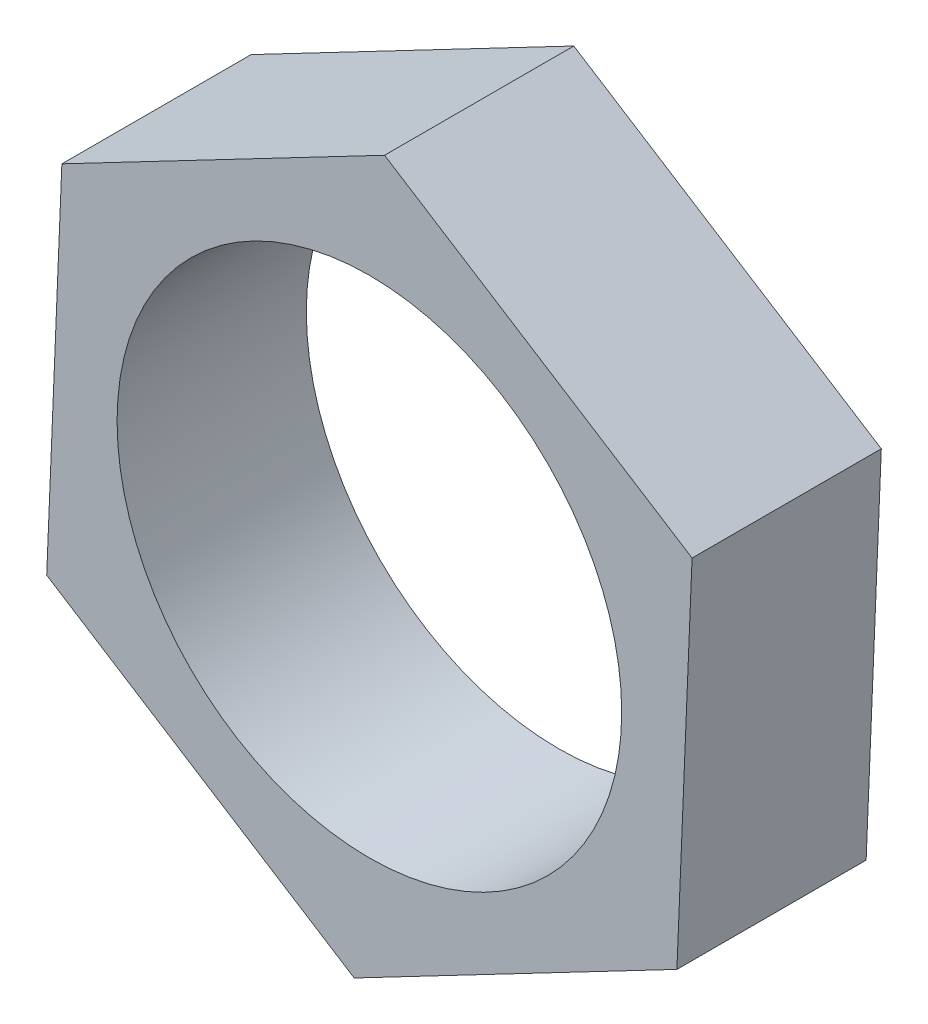
ISO-10303-21;
HEADER;
FILE_DESCRIPTION(('STEP AP214'),'2;1');
FILE_NAME('part.step','',(''),(''),'','','');
FILE_SCHEMA(('AUTOMOTIVE_DESIGN { 1 0 10303 214 1 1 1 1 }'));
ENDSEC;
DATA;
#1=APPLICATION_CONTEXT('core data for automotive mechanical design processes');
#2=APPLICATION_PROTOCOL_DEFINITION('international standard','automotive_design',2000,#1);
#3=PRODUCT_CONTEXT('',#1,'mechanical');
#4=PRODUCT('Part','Part','',(#3));
#5=PRODUCT_RELATED_PRODUCT_CATEGORY('part','',(#4));
#6=PRODUCT_DEFINITION_FORMATION('','',#4);
#7=PRODUCT_DEFINITION_CONTEXT('part definition',#1,'design');
#8=PRODUCT_DEFINITION('design','',#6,#7);
#9=PRODUCT_DEFINITION_SHAPE('','',#8);
#10=(LENGTH_UNIT() NAMED_UNIT(*) SI_UNIT(.MILLI.,.METRE.));
#11=(NAMED_UNIT(*) PLANE_ANGLE_UNIT() SI_UNIT($,.RADIAN.));
#12=(NAMED_UNIT(*) SI_UNIT($,.STERADIAN.) SOLID_ANGLE_UNIT());
#13=UNCERTAINTY_MEASURE_WITH_UNIT(LENGTH_MEASURE(1.E-05),#10,'distance_accuracy_value','');
#14=(GEOMETRIC_REPRESENTATION_CONTEXT(3) GLOBAL_UNCERTAINTY_ASSIGNED_CONTEXT((#13)) GLOBAL_UNIT_ASSIGNED_CONTEXT((#10,
#11,#12)) REPRESENTATION_CONTEXT('',''));
#15=CARTESIAN_POINT('',(0.,0.,0.));
#16=DIRECTION('',(0.,0.,1.));
#17=DIRECTION('',(1.,0.,0.));
#18=AXIS2_PLACEMENT_3D('',#15,#16,#17);
#19=CARTESIAN_POINT('',(-0.240572618673201,-5.76848837638406,3.));
#20=DIRECTION('',(-0.463479854737405,0.886107456380203,0.));
#21=DIRECTION('',(-0.886107456380204,-0.463479854737405,0.));
#22=AXIS2_PLACEMENT_3D('',#19,#20,#21);
#23=PLANE('',#22);
#24=DIRECTION('',(0.886107456380204,0.463479854737405,0.));
#25=VECTOR('',#24,1.);
#26=CARTESIAN_POINT('',(-0.240572618673201,-5.76848837638406,0.));
#27=LINE('',#26,#25);
#28=CARTESIAN_POINT('',(-0.240572618673201,-5.76848837638406,0.));
#29=VERTEX_POINT('',#28);
#30=CARTESIAN_POINT('',(4.87537116604725,-3.09258618741797,0.));
#31=VERTEX_POINT('',#30);
#32=EDGE_CURVE('E118',#29,#31,#27,.T.);
#33=ORIENTED_EDGE('',*,*,#32,.T.);
#34=DIRECTION('',(0.,0.,-1.));
#35=VECTOR('',#34,1.);
#36=CARTESIAN_POINT('',(4.87537116604725,-3.09258618741797,3.));
#37=LINE('',#36,#35);
#38=CARTESIAN_POINT('',(4.87537116604725,-3.09258618741797,3.));
#39=VERTEX_POINT('',#38);
#40=EDGE_CURVE('E11',#39,#31,#37,.T.);
#41=ORIENTED_EDGE('',*,*,#40,.F.);
#42=DIRECTION('',(0.886107456380204,0.463479854737405,0.));
#43=VECTOR('',#42,1.);
#44=CARTESIAN_POINT('',(-0.240572618673201,-5.76848837638406,3.));
#45=LINE('',#44,#43);
#46=CARTESIAN_POINT('',(-0.240572618673201,-5.76848837638406,3.));
#47=VERTEX_POINT('',#46);
#48=EDGE_CURVE('E129',#47,#39,#45,.T.);
#49=ORIENTED_EDGE('',*,*,#48,.F.);
#50=DIRECTION('',(0.,0.,-1.));
#51=VECTOR('',#50,1.);
#52=CARTESIAN_POINT('',(-0.240572618673201,-5.76848837638406,3.));
#53=LINE('',#52,#51);
#54=EDGE_CURVE('E114',#47,#29,#53,.T.);
#55=ORIENTED_EDGE('',*,*,#54,.T.);
#56=EDGE_LOOP('',(#33,#41,#49,#55));
#57=FACE_BOUND('',#56,.T.);
#58=ADVANCED_FACE('F34',(#57),#23,.F.);
#59=CARTESIAN_POINT('',(4.87537116604725,-3.09258618741797,3.));
#60=DIRECTION('',(-0.99913149507677,0.0416683998451879,0.));
#61=DIRECTION('',(-0.0416683998451879,-0.99913149507677,0.));
#62=AXIS2_PLACEMENT_3D('',#59,#60,#61);
#63=PLANE('',#62);
#64=DIRECTION('',(0.0416683998451879,0.99913149507677,0.));
#65=VECTOR('',#64,1.);
#66=CARTESIAN_POINT('',(4.87537116604725,-3.09258618741797,0.));
#67=LINE('',#66,#65);
#68=CARTESIAN_POINT('',(5.11594378472045,2.67590218896609,0.));
#69=VERTEX_POINT('',#68);
#70=EDGE_CURVE('E121',#31,#69,#67,.T.);
#71=ORIENTED_EDGE('',*,*,#70,.T.);
#72=DIRECTION('',(0.,0.,-1.));
#73=VECTOR('',#72,1.);
#74=CARTESIAN_POINT('',(5.11594378472045,2.67590218896609,3.));
#75=LINE('',#74,#73);
#76=CARTESIAN_POINT('',(5.11594378472045,2.67590218896609,3.));
#77=VERTEX_POINT('',#76);
#78=EDGE_CURVE('E42',#77,#69,#75,.T.);
#79=ORIENTED_EDGE('',*,*,#78,.F.);
#80=DIRECTION('',(0.0416683998451879,0.99913149507677,0.));
#81=VECTOR('',#80,1.);
#82=CARTESIAN_POINT('',(4.87537116604725,-3.09258618741797,3.));
#83=LINE('',#82,#81);
#84=EDGE_CURVE('E87',#39,#77,#83,.T.);
#85=ORIENTED_EDGE('',*,*,#84,.F.);
#86=ORIENTED_EDGE('',*,*,#40,.T.);
#87=EDGE_LOOP('',(#71,#79,#85,#86));
#88=FACE_BOUND('',#87,.T.);
#89=ADVANCED_FACE('F154',(#88),#63,.F.);
#90=CARTESIAN_POINT('',(5.11594378472045,2.67590218896609,3.));
#91=DIRECTION('',(-0.535651640339365,-0.844439056535016,0.));
#92=DIRECTION('',(0.844439056535016,-0.535651640339365,0.));
#93=AXIS2_PLACEMENT_3D('',#90,#91,#92);
#94=PLANE('',#93);
#95=DIRECTION('',(-0.844439056535016,0.535651640339365,0.));
#96=VECTOR('',#95,1.);
#97=CARTESIAN_POINT('',(5.11594378472045,2.67590218896609,0.));
#98=LINE('',#97,#96);
#99=CARTESIAN_POINT('',(0.240572618673201,5.76848837638406,0.));
#100=VERTEX_POINT('',#99);
#101=EDGE_CURVE('E124',#69,#100,#98,.T.);
#102=ORIENTED_EDGE('',*,*,#101,.T.);
#103=DIRECTION('',(0.,0.,-1.));
#104=VECTOR('',#103,1.);
#105=CARTESIAN_POINT('',(0.240572618673201,5.76848837638406,3.));
#106=LINE('',#105,#104);
#107=CARTESIAN_POINT('',(0.240572618673201,5.76848837638406,3.));
#108=VERTEX_POINT('',#107);
#109=EDGE_CURVE('E109',#108,#100,#106,.T.);
#110=ORIENTED_EDGE('',*,*,#109,.F.);
#111=DIRECTION('',(-0.844439056535016,0.535651640339365,0.));
#112=VECTOR('',#111,1.);
#113=CARTESIAN_POINT('',(5.11594378472045,2.67590218896609,3.));
#114=LINE('',#113,#112);
#115=EDGE_CURVE('E100',#77,#108,#114,.T.);
#116=ORIENTED_EDGE('',*,*,#115,.F.);
#117=ORIENTED_EDGE('',*,*,#78,.T.);
#118=EDGE_LOOP('',(#102,#110,#116,#117));
#119=FACE_BOUND('',#118,.T.);
#120=ADVANCED_FACE('F135',(#119),#94,.F.);
#121=CARTESIAN_POINT('',(0.240572618673201,5.76848837638406,3.));
#122=DIRECTION('',(0.463479854737405,-0.886107456380203,0.));
#123=DIRECTION('',(0.886107456380204,0.463479854737405,0.));
#124=AXIS2_PLACEMENT_3D('',#121,#122,#123);
#125=PLANE('',#124);
#126=DIRECTION('',(-0.886107456380204,-0.463479854737405,0.));
#127=VECTOR('',#126,1.);
#128=CARTESIAN_POINT('',(0.240572618673201,5.76848837638406,0.));
#129=LINE('',#128,#127);
#130=CARTESIAN_POINT('',(-4.87537116604725,3.09258618741797,0.));
#131=VERTEX_POINT('',#130);
#132=EDGE_CURVE('E108',#100,#131,#129,.T.);
#133=ORIENTED_EDGE('',*,*,#132,.T.);
#134=DIRECTION('',(0.,0.,-1.));
#135=VECTOR('',#134,1.);
#136=CARTESIAN_POINT('',(-4.87537116604725,3.09258618741797,3.));
#137=LINE('',#136,#135);
#138=CARTESIAN_POINT('',(-4.87537116604725,3.09258618741797,3.));
#139=VERTEX_POINT('',#138);
#140=EDGE_CURVE('E105',#139,#131,#137,.T.);
#141=ORIENTED_EDGE('',*,*,#140,.F.);
#142=DIRECTION('',(-0.886107456380204,-0.463479854737405,0.));
#143=VECTOR('',#142,1.);
#144=CARTESIAN_POINT('',(0.240572618673201,5.76848837638406,3.));
#145=LINE('',#144,#143);
#146=EDGE_CURVE('E94',#108,#139,#145,.T.);
#147=ORIENTED_EDGE('',*,*,#146,.F.);
#148=ORIENTED_EDGE('',*,*,#109,.T.);
#149=EDGE_LOOP('',(#133,#141,#147,#148));
#150=FACE_BOUND('',#149,.T.);
#151=ADVANCED_FACE('F106',(#150),#125,.F.);
#152=CARTESIAN_POINT('',(-4.87537116604725,3.09258618741797,3.));
#153=DIRECTION('',(0.99913149507677,-0.0416683998451877,0.));
#154=DIRECTION('',(0.0416683998451877,0.99913149507677,0.));
#155=AXIS2_PLACEMENT_3D('',#152,#153,#154);
#156=PLANE('',#155);
#157=DIRECTION('',(-0.0416683998451877,-0.99913149507677,0.));
#158=VECTOR('',#157,1.);
#159=CARTESIAN_POINT('',(-4.87537116604725,3.09258618741797,0.));
#160=LINE('',#159,#158);
#161=CARTESIAN_POINT('',(-5.11594378472045,-2.67590218896609,0.));
#162=VERTEX_POINT('',#161);
#163=EDGE_CURVE('E73',#131,#162,#160,.T.);
#164=ORIENTED_EDGE('',*,*,#163,.T.);
#165=DIRECTION('',(0.,0.,-1.));
#166=VECTOR('',#165,1.);
#167=CARTESIAN_POINT('',(-5.11594378472045,-2.67590218896609,3.));
#168=LINE('',#167,#166);
#169=CARTESIAN_POINT('',(-5.11594378472045,-2.67590218896609,3.));
#170=VERTEX_POINT('',#169);
#171=EDGE_CURVE('E110',#170,#162,#168,.T.);
#172=ORIENTED_EDGE('',*,*,#171,.F.);
#173=DIRECTION('',(-0.0416683998451877,-0.99913149507677,0.));
#174=VECTOR('',#173,1.);
#175=CARTESIAN_POINT('',(-4.87537116604725,3.09258618741797,3.));
#176=LINE('',#175,#174);
#177=EDGE_CURVE('E98',#139,#170,#176,.T.);
#178=ORIENTED_EDGE('',*,*,#177,.F.);
#179=ORIENTED_EDGE('',*,*,#140,.T.);
#180=EDGE_LOOP('',(#164,#172,#178,#179));
#181=FACE_BOUND('',#180,.T.);
#182=ADVANCED_FACE('F112',(#181),#156,.F.);
#183=CARTESIAN_POINT('',(-5.11594378472045,-2.67590218896609,3.));
#184=DIRECTION('',(0.535651640339365,0.844439056535015,0.));
#185=DIRECTION('',(-0.844439056535016,0.535651640339365,0.));
#186=AXIS2_PLACEMENT_3D('',#183,#184,#185);
#187=PLANE('',#186);
#188=DIRECTION('',(0.844439056535016,-0.535651640339365,0.));
#189=VECTOR('',#188,1.);
#190=CARTESIAN_POINT('',(-5.11594378472045,-2.67590218896609,0.));
#191=LINE('',#190,#189);
#192=EDGE_CURVE('E79',#162,#29,#191,.T.);
#193=ORIENTED_EDGE('',*,*,#192,.T.);
#194=ORIENTED_EDGE('',*,*,#54,.F.);
#195=DIRECTION('',(0.844439056535016,-0.535651640339365,0.));
#196=VECTOR('',#195,1.);
#197=CARTESIAN_POINT('',(-5.11594378472045,-2.67590218896609,3.));
#198=LINE('',#197,#196);
#199=EDGE_CURVE('E50',#170,#47,#198,.T.);
#200=ORIENTED_EDGE('',*,*,#199,.F.);
#201=ORIENTED_EDGE('',*,*,#171,.T.);
#202=EDGE_LOOP('',(#193,#194,#200,#201));
#203=FACE_BOUND('',#202,.T.);
#204=ADVANCED_FACE('F142',(#203),#187,.F.);
#205=CARTESIAN_POINT('',(0.,0.,3.));
#206=DIRECTION('',(0.,0.,1.));
#207=DIRECTION('',(1.,0.,0.));
#208=AXIS2_PLACEMENT_3D('',#205,#206,#207);
#209=PLANE('',#208);
#210=CARTESIAN_POINT('',(0.,0.,3.));
#211=DIRECTION('',(0.,0.,1.));
#212=DIRECTION('',(1.,0.,0.));
#213=AXIS2_PLACEMENT_3D('',#210,#211,#212);
#214=CIRCLE('',#213,4.);
#215=CARTESIAN_POINT('',(4.,0.,3.));
#216=VERTEX_POINT('',#215);
#217=EDGE_CURVE('E209',#216,#216,#214,.T.);
#218=ORIENTED_EDGE('',*,*,#217,.F.);
#219=EDGE_LOOP('',(#218));
#220=FACE_BOUND('',#219,.T.);
#221=ORIENTED_EDGE('',*,*,#48,.T.);
#222=ORIENTED_EDGE('',*,*,#84,.T.);
#223=ORIENTED_EDGE('',*,*,#115,.T.);
#224=ORIENTED_EDGE('',*,*,#146,.T.);
#225=ORIENTED_EDGE('',*,*,#177,.T.);
#226=ORIENTED_EDGE('',*,*,#199,.T.);
#227=EDGE_LOOP('',(#221,#222,#223,#224,#225,#226));
#228=FACE_BOUND('',#227,.T.);
#229=ADVANCED_FACE('F96',(#220,#228),#209,.T.);
#230=CARTESIAN_POINT('',(0.,0.,0.));
#231=DIRECTION('',(0.,0.,1.));
#232=DIRECTION('',(1.,0.,0.));
#233=AXIS2_PLACEMENT_3D('',#230,#231,#232);
#234=PLANE('',#233);
#235=CARTESIAN_POINT('',(0.,0.,0.));
#236=DIRECTION('',(0.,0.,1.));
#237=DIRECTION('',(1.,0.,0.));
#238=AXIS2_PLACEMENT_3D('',#235,#236,#237);
#239=CIRCLE('',#238,4.);
#240=CARTESIAN_POINT('',(4.,0.,0.));
#241=VERTEX_POINT('',#240);
#242=EDGE_CURVE('E122',#241,#241,#239,.T.);
#243=ORIENTED_EDGE('',*,*,#242,.T.);
#244=EDGE_LOOP('',(#243));
#245=FACE_BOUND('',#244,.T.);
#246=ORIENTED_EDGE('',*,*,#32,.F.);
#247=ORIENTED_EDGE('',*,*,#192,.F.);
#248=ORIENTED_EDGE('',*,*,#163,.F.);
#249=ORIENTED_EDGE('',*,*,#132,.F.);
#250=ORIENTED_EDGE('',*,*,#101,.F.);
#251=ORIENTED_EDGE('',*,*,#70,.F.);
#252=EDGE_LOOP('',(#246,#247,#248,#249,#250,#251));
#253=FACE_BOUND('',#252,.T.);
#254=ADVANCED_FACE('F138',(#245,#253),#234,.F.);
#255=CARTESIAN_POINT('',(0.,0.,0.));
#256=DIRECTION('',(0.,0.,1.));
#257=DIRECTION('',(1.,0.,0.));
#258=AXIS2_PLACEMENT_3D('',#255,#256,#257);
#259=CYLINDRICAL_SURFACE('',#258,4.);
#260=ORIENTED_EDGE('',*,*,#242,.F.);
#261=EDGE_LOOP('',(#260));
#262=FACE_BOUND('',#261,.T.);
#263=ORIENTED_EDGE('',*,*,#217,.T.);
#264=EDGE_LOOP('',(#263));
#265=FACE_BOUND('',#264,.T.);
#266=ADVANCED_FACE('F191',(#262,#265),#259,.F.);
#267=CLOSED_SHELL('',(#58,#89,#120,#151,#182,#204,#229,#254,#266));
#268=MANIFOLD_SOLID_BREP('B2',#267);
#269=ADVANCED_BREP_SHAPE_REPRESENTATION('',(#18,#268),#14);
#270=SHAPE_DEFINITION_REPRESENTATION(#9,#269);
ENDSEC;
END-ISO-10303-21;
